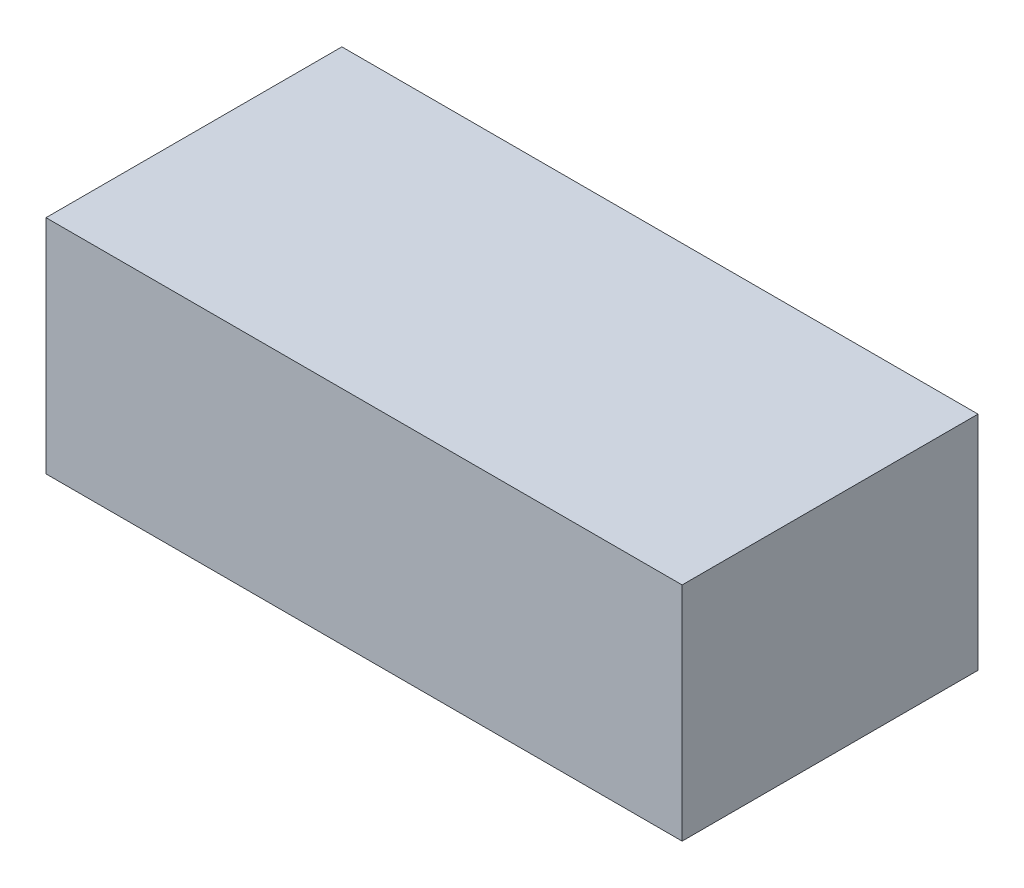
ISO-10303-21;
HEADER;
FILE_DESCRIPTION(('STEP AP214'),'2;1');
FILE_NAME('part.step','',(''),(''),'','','');
FILE_SCHEMA(('AUTOMOTIVE_DESIGN { 1 0 10303 214 1 1 1 1 }'));
ENDSEC;
DATA;
#1=APPLICATION_CONTEXT('core data for automotive mechanical design processes');
#2=APPLICATION_PROTOCOL_DEFINITION('international standard','automotive_design',2000,#1);
#3=PRODUCT_CONTEXT('',#1,'mechanical');
#4=PRODUCT('Part','Part','',(#3));
#5=PRODUCT_RELATED_PRODUCT_CATEGORY('part','',(#4));
#6=PRODUCT_DEFINITION_FORMATION('','',#4);
#7=PRODUCT_DEFINITION_CONTEXT('part definition',#1,'design');
#8=PRODUCT_DEFINITION('design','',#6,#7);
#9=PRODUCT_DEFINITION_SHAPE('','',#8);
#10=(LENGTH_UNIT() NAMED_UNIT(*) SI_UNIT(.MILLI.,.METRE.));
#11=(NAMED_UNIT(*) PLANE_ANGLE_UNIT() SI_UNIT($,.RADIAN.));
#12=(NAMED_UNIT(*) SI_UNIT($,.STERADIAN.) SOLID_ANGLE_UNIT());
#13=UNCERTAINTY_MEASURE_WITH_UNIT(LENGTH_MEASURE(1.E-05),#10,'distance_accuracy_value','');
#14=(GEOMETRIC_REPRESENTATION_CONTEXT(3) GLOBAL_UNCERTAINTY_ASSIGNED_CONTEXT((#13)) GLOBAL_UNIT_ASSIGNED_CONTEXT((#10,
#11,#12)) REPRESENTATION_CONTEXT('',''));
#15=CARTESIAN_POINT('',(0.,0.,0.));
#16=DIRECTION('',(0.,0.,1.));
#17=DIRECTION('',(1.,0.,0.));
#18=AXIS2_PLACEMENT_3D('',#15,#16,#17);
#19=CARTESIAN_POINT('',(21.5,15.,-10.));
#20=DIRECTION('',(-1.,0.,0.));
#21=DIRECTION('',(0.,0.,1.));
#22=AXIS2_PLACEMENT_3D('',#19,#20,#21);
#23=PLANE('',#22);
#24=DIRECTION('',(0.,0.,-1.));
#25=VECTOR('',#24,1.);
#26=CARTESIAN_POINT('',(21.5,0.,-10.));
#27=LINE('',#26,#25);
#28=CARTESIAN_POINT('',(21.5,0.,10.));
#29=VERTEX_POINT('',#28);
#30=CARTESIAN_POINT('',(21.5,0.,-10.));
#31=VERTEX_POINT('',#30);
#32=EDGE_CURVE('E96',#29,#31,#27,.T.);
#33=ORIENTED_EDGE('',*,*,#32,.T.);
#34=DIRECTION('',(0.,-1.,0.));
#35=VECTOR('',#34,1.);
#36=CARTESIAN_POINT('',(21.5,15.,-10.));
#37=LINE('',#36,#35);
#38=CARTESIAN_POINT('',(21.5,15.,-10.));
#39=VERTEX_POINT('',#38);
#40=EDGE_CURVE('E11',#39,#31,#37,.T.);
#41=ORIENTED_EDGE('',*,*,#40,.F.);
#42=DIRECTION('',(0.,0.,-1.));
#43=VECTOR('',#42,1.);
#44=CARTESIAN_POINT('',(21.5,15.,-10.));
#45=LINE('',#44,#43);
#46=CARTESIAN_POINT('',(21.5,15.,10.));
#47=VERTEX_POINT('',#46);
#48=EDGE_CURVE('E84',#47,#39,#45,.T.);
#49=ORIENTED_EDGE('',*,*,#48,.F.);
#50=DIRECTION('',(0.,-1.,0.));
#51=VECTOR('',#50,1.);
#52=CARTESIAN_POINT('',(21.5,15.,10.));
#53=LINE('',#52,#51);
#54=EDGE_CURVE('E92',#47,#29,#53,.T.);
#55=ORIENTED_EDGE('',*,*,#54,.T.);
#56=EDGE_LOOP('',(#33,#41,#49,#55));
#57=FACE_BOUND('',#56,.T.);
#58=ADVANCED_FACE('F33',(#57),#23,.F.);
#59=CARTESIAN_POINT('',(-21.5,15.,-10.));
#60=DIRECTION('',(0.,0.,1.));
#61=DIRECTION('',(1.,0.,0.));
#62=AXIS2_PLACEMENT_3D('',#59,#60,#61);
#63=PLANE('',#62);
#64=DIRECTION('',(-1.,0.,0.));
#65=VECTOR('',#64,1.);
#66=CARTESIAN_POINT('',(-21.5,0.,-10.));
#67=LINE('',#66,#65);
#68=CARTESIAN_POINT('',(-21.5,0.,-10.));
#69=VERTEX_POINT('',#68);
#70=EDGE_CURVE('E88',#31,#69,#67,.T.);
#71=ORIENTED_EDGE('',*,*,#70,.T.);
#72=DIRECTION('',(0.,-1.,0.));
#73=VECTOR('',#72,1.);
#74=CARTESIAN_POINT('',(-21.5,15.,-10.));
#75=LINE('',#74,#73);
#76=CARTESIAN_POINT('',(-21.5,15.,-10.));
#77=VERTEX_POINT('',#76);
#78=EDGE_CURVE('E41',#77,#69,#75,.T.);
#79=ORIENTED_EDGE('',*,*,#78,.F.);
#80=DIRECTION('',(-1.,0.,0.));
#81=VECTOR('',#80,1.);
#82=CARTESIAN_POINT('',(-21.5,15.,-10.));
#83=LINE('',#82,#81);
#84=EDGE_CURVE('E79',#39,#77,#83,.T.);
#85=ORIENTED_EDGE('',*,*,#84,.F.);
#86=ORIENTED_EDGE('',*,*,#40,.T.);
#87=EDGE_LOOP('',(#71,#79,#85,#86));
#88=FACE_BOUND('',#87,.T.);
#89=ADVANCED_FACE('F87',(#88),#63,.F.);
#90=CARTESIAN_POINT('',(-21.5,15.,-10.));
#91=DIRECTION('',(1.,0.,0.));
#92=DIRECTION('',(0.,0.,-1.));
#93=AXIS2_PLACEMENT_3D('',#90,#91,#92);
#94=PLANE('',#93);
#95=DIRECTION('',(0.,0.,1.));
#96=VECTOR('',#95,1.);
#97=CARTESIAN_POINT('',(-21.5,0.,-10.));
#98=LINE('',#97,#96);
#99=CARTESIAN_POINT('',(-21.5,0.,10.));
#100=VERTEX_POINT('',#99);
#101=EDGE_CURVE('E66',#69,#100,#98,.T.);
#102=ORIENTED_EDGE('',*,*,#101,.T.);
#103=DIRECTION('',(0.,-1.,0.));
#104=VECTOR('',#103,1.);
#105=CARTESIAN_POINT('',(-21.5,15.,10.));
#106=LINE('',#105,#104);
#107=CARTESIAN_POINT('',(-21.5,15.,10.));
#108=VERTEX_POINT('',#107);
#109=EDGE_CURVE('E89',#108,#100,#106,.T.);
#110=ORIENTED_EDGE('',*,*,#109,.F.);
#111=DIRECTION('',(0.,0.,1.));
#112=VECTOR('',#111,1.);
#113=CARTESIAN_POINT('',(-21.5,15.,-10.));
#114=LINE('',#113,#112);
#115=EDGE_CURVE('E82',#77,#108,#114,.T.);
#116=ORIENTED_EDGE('',*,*,#115,.F.);
#117=ORIENTED_EDGE('',*,*,#78,.T.);
#118=EDGE_LOOP('',(#102,#110,#116,#117));
#119=FACE_BOUND('',#118,.T.);
#120=ADVANCED_FACE('F90',(#119),#94,.F.);
#121=CARTESIAN_POINT('',(-21.5,15.,10.));
#122=DIRECTION('',(0.,0.,-1.));
#123=DIRECTION('',(-1.,0.,0.));
#124=AXIS2_PLACEMENT_3D('',#121,#122,#123);
#125=PLANE('',#124);
#126=DIRECTION('',(1.,0.,0.));
#127=VECTOR('',#126,1.);
#128=CARTESIAN_POINT('',(-21.5,0.,10.));
#129=LINE('',#128,#127);
#130=EDGE_CURVE('E72',#100,#29,#129,.T.);
#131=ORIENTED_EDGE('',*,*,#130,.T.);
#132=ORIENTED_EDGE('',*,*,#54,.F.);
#133=DIRECTION('',(1.,0.,0.));
#134=VECTOR('',#133,1.);
#135=CARTESIAN_POINT('',(-21.5,15.,10.));
#136=LINE('',#135,#134);
#137=EDGE_CURVE('E49',#108,#47,#136,.T.);
#138=ORIENTED_EDGE('',*,*,#137,.F.);
#139=ORIENTED_EDGE('',*,*,#109,.T.);
#140=EDGE_LOOP('',(#131,#132,#138,#139));
#141=FACE_BOUND('',#140,.T.);
#142=ADVANCED_FACE('F103',(#141),#125,.F.);
#143=CARTESIAN_POINT('',(0.,15.,0.));
#144=DIRECTION('',(0.,1.,0.));
#145=DIRECTION('',(0.,0.,1.));
#146=AXIS2_PLACEMENT_3D('',#143,#144,#145);
#147=PLANE('',#146);
#148=ORIENTED_EDGE('',*,*,#48,.T.);
#149=ORIENTED_EDGE('',*,*,#84,.T.);
#150=ORIENTED_EDGE('',*,*,#115,.T.);
#151=ORIENTED_EDGE('',*,*,#137,.T.);
#152=EDGE_LOOP('',(#148,#149,#150,#151));
#153=FACE_BOUND('',#152,.T.);
#154=ADVANCED_FACE('F80',(#153),#147,.T.);
#155=CARTESIAN_POINT('',(0.,0.,0.));
#156=DIRECTION('',(0.,1.,0.));
#157=DIRECTION('',(0.,0.,1.));
#158=AXIS2_PLACEMENT_3D('',#155,#156,#157);
#159=PLANE('',#158);
#160=ORIENTED_EDGE('',*,*,#32,.F.);
#161=ORIENTED_EDGE('',*,*,#130,.F.);
#162=ORIENTED_EDGE('',*,*,#101,.F.);
#163=ORIENTED_EDGE('',*,*,#70,.F.);
#164=EDGE_LOOP('',(#160,#161,#162,#163));
#165=FACE_BOUND('',#164,.T.);
#166=ADVANCED_FACE('F106',(#165),#159,.F.);
#167=CLOSED_SHELL('',(#58,#89,#120,#142,#154,#166));
#168=MANIFOLD_SOLID_BREP('B2',#167);
#169=ADVANCED_BREP_SHAPE_REPRESENTATION('',(#18,#168),#14);
#170=SHAPE_DEFINITION_REPRESENTATION(#9,#169);
ENDSEC;
END-ISO-10303-21;
